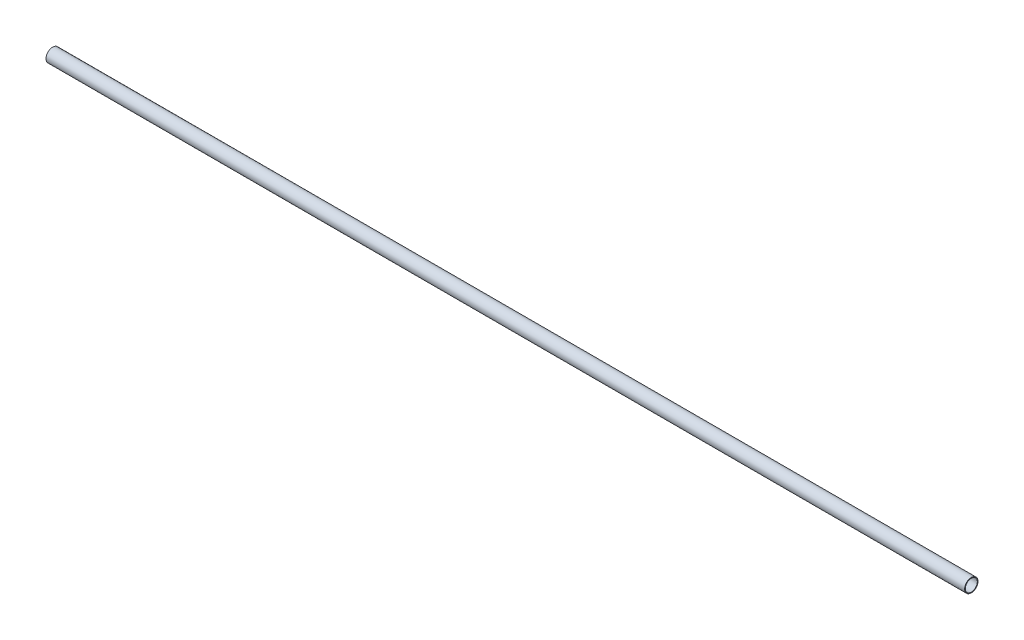
ISO-10303-21;
HEADER;
FILE_DESCRIPTION(('STEP AP214'),'2;1');
FILE_NAME('part.step','',(''),(''),'','','');
FILE_SCHEMA(('AUTOMOTIVE_DESIGN { 1 0 10303 214 1 1 1 1 }'));
ENDSEC;
DATA;
#1=APPLICATION_CONTEXT('core data for automotive mechanical design processes');
#2=APPLICATION_PROTOCOL_DEFINITION('international standard','automotive_design',2000,#1);
#3=PRODUCT_CONTEXT('',#1,'mechanical');
#4=PRODUCT('Part','Part','',(#3));
#5=PRODUCT_RELATED_PRODUCT_CATEGORY('part','',(#4));
#6=PRODUCT_DEFINITION_FORMATION('','',#4);
#7=PRODUCT_DEFINITION_CONTEXT('part definition',#1,'design');
#8=PRODUCT_DEFINITION('design','',#6,#7);
#9=PRODUCT_DEFINITION_SHAPE('','',#8);
#10=(LENGTH_UNIT() NAMED_UNIT(*) SI_UNIT(.MILLI.,.METRE.));
#11=(NAMED_UNIT(*) PLANE_ANGLE_UNIT() SI_UNIT($,.RADIAN.));
#12=(NAMED_UNIT(*) SI_UNIT($,.STERADIAN.) SOLID_ANGLE_UNIT());
#13=UNCERTAINTY_MEASURE_WITH_UNIT(LENGTH_MEASURE(1.E-05),#10,'distance_accuracy_value','');
#14=(GEOMETRIC_REPRESENTATION_CONTEXT(3) GLOBAL_UNCERTAINTY_ASSIGNED_CONTEXT((#13)) GLOBAL_UNIT_ASSIGNED_CONTEXT((#10,
#11,#12)) REPRESENTATION_CONTEXT('',''));
#15=CARTESIAN_POINT('',(0.,0.,0.));
#16=DIRECTION('',(0.,0.,1.));
#17=DIRECTION('',(1.,0.,0.));
#18=AXIS2_PLACEMENT_3D('',#15,#16,#17);
#19=CARTESIAN_POINT('',(207.,25.3999999999999,0.));
#20=DIRECTION('',(-1.,0.,0.));
#21=DIRECTION('',(0.,-1.,0.));
#22=AXIS2_PLACEMENT_3D('',#19,#20,#21);
#23=PLANE('',#22);
#24=CARTESIAN_POINT('',(207.,0.,0.));
#25=DIRECTION('',(1.,0.,0.));
#26=DIRECTION('',(0.,1.,0.));
#27=AXIS2_PLACEMENT_3D('',#24,#25,#26);
#28=CIRCLE('',#27,25.4999999999995);
#29=CARTESIAN_POINT('',(207.,25.4999999999995,0.));
#30=VERTEX_POINT('',#29);
#31=EDGE_CURVE('E43',#30,#30,#28,.T.);
#32=ORIENTED_EDGE('',*,*,#31,.T.);
#33=EDGE_LOOP('',(#32));
#34=FACE_BOUND('',#33,.T.);
#35=CARTESIAN_POINT('',(207.,0.,0.));
#36=DIRECTION('',(1.,0.,0.));
#37=DIRECTION('',(0.,1.,0.));
#38=AXIS2_PLACEMENT_3D('',#35,#36,#37);
#39=CIRCLE('',#38,28.4999999999999);
#40=CARTESIAN_POINT('',(207.,28.4999999999999,0.));
#41=VERTEX_POINT('',#40);
#42=EDGE_CURVE('E10',#41,#41,#39,.T.);
#43=ORIENTED_EDGE('',*,*,#42,.F.);
#44=EDGE_LOOP('',(#43));
#45=FACE_BOUND('',#44,.T.);
#46=ADVANCED_FACE('F33',(#34,#45),#23,.T.);
#47=CARTESIAN_POINT('',(4097.,3.52981261132976E-13,0.));
#48=DIRECTION('',(1.,0.,0.));
#49=DIRECTION('',(0.,1.,0.));
#50=AXIS2_PLACEMENT_3D('',#47,#48,#49);
#51=CYLINDRICAL_SURFACE('',#50,28.4999999999997);
#52=ORIENTED_EDGE('',*,*,#42,.T.);
#53=EDGE_LOOP('',(#52));
#54=FACE_BOUND('',#53,.T.);
#55=CARTESIAN_POINT('',(4122.,3.55645956212641E-13,0.));
#56=DIRECTION('',(1.,0.,0.));
#57=DIRECTION('',(0.,1.,0.));
#58=AXIS2_PLACEMENT_3D('',#55,#56,#57);
#59=CIRCLE('',#58,28.4999999999995);
#60=CARTESIAN_POINT('',(4122.,28.4999999999999,0.));
#61=VERTEX_POINT('',#60);
#62=EDGE_CURVE('E39',#61,#61,#59,.T.);
#63=ORIENTED_EDGE('',*,*,#62,.F.);
#64=EDGE_LOOP('',(#63));
#65=FACE_BOUND('',#64,.T.);
#66=ADVANCED_FACE('F57',(#54,#65),#51,.T.);
#67=CARTESIAN_POINT('',(4122.,25.3999999999999,0.));
#68=DIRECTION('',(1.,0.,0.));
#69=DIRECTION('',(0.,1.,0.));
#70=AXIS2_PLACEMENT_3D('',#67,#68,#69);
#71=PLANE('',#70);
#72=CARTESIAN_POINT('',(4122.,3.55645956212641E-13,0.));
#73=DIRECTION('',(1.,0.,0.));
#74=DIRECTION('',(0.,1.,0.));
#75=AXIS2_PLACEMENT_3D('',#72,#73,#74);
#76=CIRCLE('',#75,25.4999999999995);
#77=CARTESIAN_POINT('',(4122.,25.4999999999999,0.));
#78=VERTEX_POINT('',#77);
#79=EDGE_CURVE('E47',#78,#78,#76,.T.);
#80=ORIENTED_EDGE('',*,*,#79,.F.);
#81=EDGE_LOOP('',(#80));
#82=FACE_BOUND('',#81,.T.);
#83=ORIENTED_EDGE('',*,*,#62,.T.);
#84=EDGE_LOOP('',(#83));
#85=FACE_BOUND('',#84,.T.);
#86=ADVANCED_FACE('F55',(#82,#85),#71,.T.);
#87=CARTESIAN_POINT('',(207.,0.,0.));
#88=DIRECTION('',(1.,0.,0.));
#89=DIRECTION('',(0.,1.,0.));
#90=AXIS2_PLACEMENT_3D('',#87,#88,#89);
#91=CYLINDRICAL_SURFACE('',#90,25.4999999999995);
#92=ORIENTED_EDGE('',*,*,#31,.F.);
#93=EDGE_LOOP('',(#92));
#94=FACE_BOUND('',#93,.T.);
#95=ORIENTED_EDGE('',*,*,#79,.T.);
#96=EDGE_LOOP('',(#95));
#97=FACE_BOUND('',#96,.T.);
#98=ADVANCED_FACE('F53',(#94,#97),#91,.F.);
#99=CLOSED_SHELL('',(#46,#66,#86,#98));
#100=MANIFOLD_SOLID_BREP('B2',#99);
#101=ADVANCED_BREP_SHAPE_REPRESENTATION('',(#18,#100),#14);
#102=SHAPE_DEFINITION_REPRESENTATION(#9,#101);
ENDSEC;
END-ISO-10303-21;
